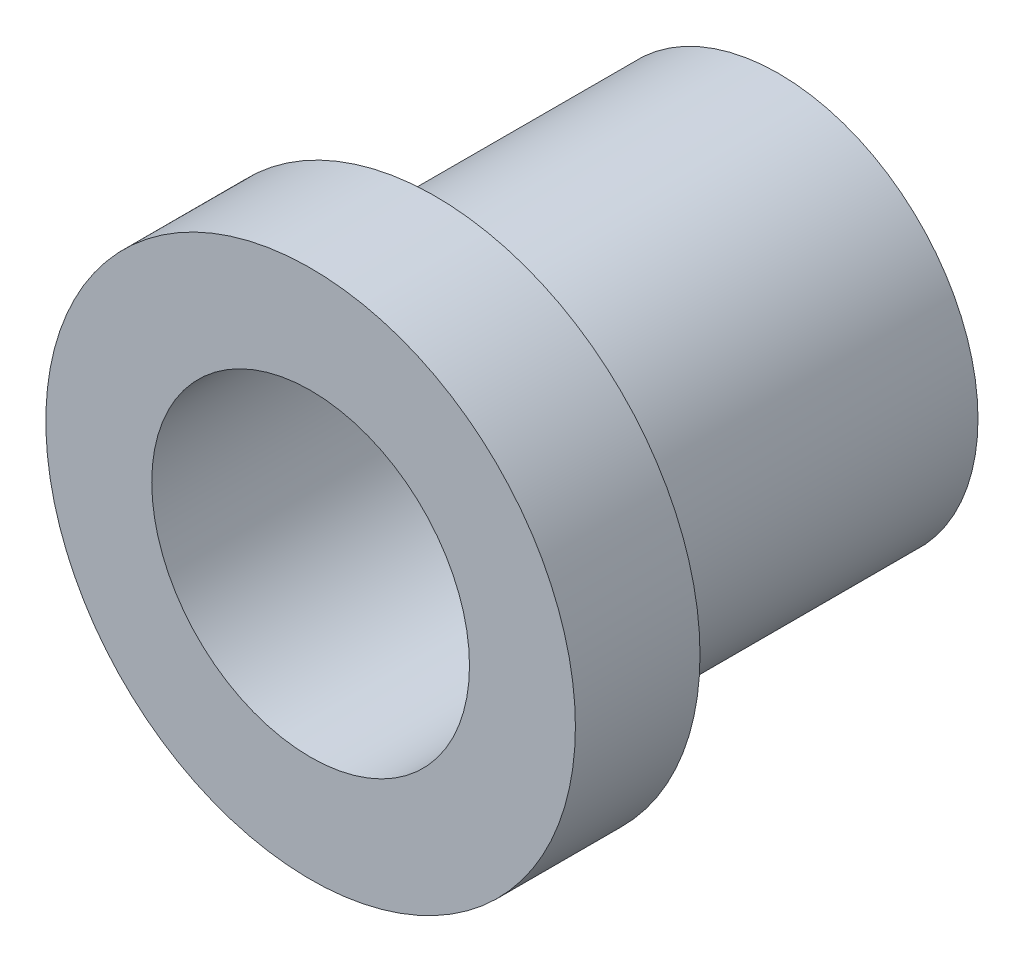
ISO-10303-21;
HEADER;
FILE_DESCRIPTION(('STEP AP214'),'2;1');
FILE_NAME('part.step','',(''),(''),'','','');
FILE_SCHEMA(('AUTOMOTIVE_DESIGN { 1 0 10303 214 1 1 1 1 }'));
ENDSEC;
DATA;
#1=APPLICATION_CONTEXT('core data for automotive mechanical design processes');
#2=APPLICATION_PROTOCOL_DEFINITION('international standard','automotive_design',2000,#1);
#3=PRODUCT_CONTEXT('',#1,'mechanical');
#4=PRODUCT('Part','Part','',(#3));
#5=PRODUCT_RELATED_PRODUCT_CATEGORY('part','',(#4));
#6=PRODUCT_DEFINITION_FORMATION('','',#4);
#7=PRODUCT_DEFINITION_CONTEXT('part definition',#1,'design');
#8=PRODUCT_DEFINITION('design','',#6,#7);
#9=PRODUCT_DEFINITION_SHAPE('','',#8);
#10=(LENGTH_UNIT() NAMED_UNIT(*) SI_UNIT(.MILLI.,.METRE.));
#11=(NAMED_UNIT(*) PLANE_ANGLE_UNIT() SI_UNIT($,.RADIAN.));
#12=(NAMED_UNIT(*) SI_UNIT($,.STERADIAN.) SOLID_ANGLE_UNIT());
#13=UNCERTAINTY_MEASURE_WITH_UNIT(LENGTH_MEASURE(1.E-05),#10,'distance_accuracy_value','');
#14=(GEOMETRIC_REPRESENTATION_CONTEXT(3) GLOBAL_UNCERTAINTY_ASSIGNED_CONTEXT((#13)) GLOBAL_UNIT_ASSIGNED_CONTEXT((#10,
#11,#12)) REPRESENTATION_CONTEXT('',''));
#15=CARTESIAN_POINT('',(0.,0.,0.));
#16=DIRECTION('',(0.,0.,1.));
#17=DIRECTION('',(1.,0.,0.));
#18=AXIS2_PLACEMENT_3D('',#15,#16,#17);
#19=CARTESIAN_POINT('',(0.,0.,0.));
#20=DIRECTION('',(0.,0.,1.));
#21=DIRECTION('',(1.,0.,0.));
#22=AXIS2_PLACEMENT_3D('',#19,#20,#21);
#23=PLANE('',#22);
#24=CARTESIAN_POINT('',(0.,0.,0.));
#25=DIRECTION('',(0.,0.,1.));
#26=DIRECTION('',(1.,0.,0.));
#27=AXIS2_PLACEMENT_3D('',#24,#25,#26);
#28=CIRCLE('',#27,5.3975);
#29=CARTESIAN_POINT('',(5.3975,0.,0.));
#30=VERTEX_POINT('',#29);
#31=EDGE_CURVE('E42',#30,#30,#28,.T.);
#32=ORIENTED_EDGE('',*,*,#31,.F.);
#33=EDGE_LOOP('',(#32));
#34=FACE_BOUND('',#33,.T.);
#35=CARTESIAN_POINT('',(0.,0.,0.));
#36=DIRECTION('',(0.,0.,1.));
#37=DIRECTION('',(1.,0.,0.));
#38=AXIS2_PLACEMENT_3D('',#35,#36,#37);
#39=CIRCLE('',#38,4.064);
#40=CARTESIAN_POINT('',(4.064,0.,0.));
#41=VERTEX_POINT('',#40);
#42=EDGE_CURVE('E10',#41,#41,#39,.F.);
#43=ORIENTED_EDGE('',*,*,#42,.F.);
#44=EDGE_LOOP('',(#43));
#45=FACE_BOUND('',#44,.T.);
#46=ADVANCED_FACE('F31',(#34,#45),#23,.F.);
#47=CARTESIAN_POINT('',(0.,0.,2.54));
#48=DIRECTION('',(0.,0.,1.));
#49=DIRECTION('',(1.,0.,0.));
#50=AXIS2_PLACEMENT_3D('',#47,#48,#49);
#51=PLANE('',#50);
#52=CARTESIAN_POINT('',(0.,0.,2.54));
#53=DIRECTION('',(0.,0.,1.));
#54=DIRECTION('',(1.,0.,0.));
#55=AXIS2_PLACEMENT_3D('',#52,#53,#54);
#56=CIRCLE('',#55,5.3975);
#57=CARTESIAN_POINT('',(5.3975,0.,2.54));
#58=VERTEX_POINT('',#57);
#59=EDGE_CURVE('E38',#58,#58,#56,.T.);
#60=ORIENTED_EDGE('',*,*,#59,.T.);
#61=EDGE_LOOP('',(#60));
#62=FACE_BOUND('',#61,.T.);
#63=CARTESIAN_POINT('',(0.,0.,2.54));
#64=DIRECTION('',(0.,0.,1.));
#65=DIRECTION('',(1.,0.,0.));
#66=AXIS2_PLACEMENT_3D('',#63,#64,#65);
#67=CIRCLE('',#66,3.2385);
#68=CARTESIAN_POINT('',(3.2385,0.,2.54));
#69=VERTEX_POINT('',#68);
#70=EDGE_CURVE('E47',#69,#69,#67,.T.);
#71=ORIENTED_EDGE('',*,*,#70,.F.);
#72=EDGE_LOOP('',(#71));
#73=FACE_BOUND('',#72,.T.);
#74=ADVANCED_FACE('F74',(#62,#73),#51,.T.);
#75=CARTESIAN_POINT('',(0.,0.,2.54));
#76=DIRECTION('',(0.,0.,-1.));
#77=DIRECTION('',(-1.,0.,0.));
#78=AXIS2_PLACEMENT_3D('',#75,#76,#77);
#79=CYLINDRICAL_SURFACE('',#78,5.3975);
#80=ORIENTED_EDGE('',*,*,#59,.F.);
#81=EDGE_LOOP('',(#80));
#82=FACE_BOUND('',#81,.T.);
#83=ORIENTED_EDGE('',*,*,#31,.T.);
#84=EDGE_LOOP('',(#83));
#85=FACE_BOUND('',#84,.T.);
#86=ADVANCED_FACE('F33',(#82,#85),#79,.T.);
#87=CARTESIAN_POINT('',(0.,0.,2.54));
#88=DIRECTION('',(0.,0.,-1.));
#89=DIRECTION('',(-1.,0.,0.));
#90=AXIS2_PLACEMENT_3D('',#87,#88,#89);
#91=CYLINDRICAL_SURFACE('',#90,3.2385);
#92=ORIENTED_EDGE('',*,*,#70,.T.);
#93=EDGE_LOOP('',(#92));
#94=FACE_BOUND('',#93,.T.);
#95=CARTESIAN_POINT('',(0.,0.,-7.));
#96=DIRECTION('',(0.,0.,-1.));
#97=DIRECTION('',(-1.,0.,0.));
#98=AXIS2_PLACEMENT_3D('',#95,#96,#97);
#99=CIRCLE('',#98,3.2385);
#100=CARTESIAN_POINT('',(-3.2385,0.,-7.));
#101=VERTEX_POINT('',#100);
#102=EDGE_CURVE('E54',#101,#101,#99,.T.);
#103=ORIENTED_EDGE('',*,*,#102,.T.);
#104=EDGE_LOOP('',(#103));
#105=FACE_BOUND('',#104,.T.);
#106=ADVANCED_FACE('F58',(#94,#105),#91,.F.);
#107=CARTESIAN_POINT('',(0.,0.,-7.));
#108=DIRECTION('',(0.,0.,-1.));
#109=DIRECTION('',(-1.,0.,0.));
#110=AXIS2_PLACEMENT_3D('',#107,#108,#109);
#111=PLANE('',#110);
#112=CARTESIAN_POINT('',(0.,0.,-7.));
#113=DIRECTION('',(0.,0.,-1.));
#114=DIRECTION('',(-1.,0.,0.));
#115=AXIS2_PLACEMENT_3D('',#112,#113,#114);
#116=CIRCLE('',#115,4.064);
#117=CARTESIAN_POINT('',(-4.064,0.,-7.));
#118=VERTEX_POINT('',#117);
#119=EDGE_CURVE('E51',#118,#118,#116,.T.);
#120=ORIENTED_EDGE('',*,*,#119,.T.);
#121=EDGE_LOOP('',(#120));
#122=FACE_BOUND('',#121,.T.);
#123=ORIENTED_EDGE('',*,*,#102,.F.);
#124=EDGE_LOOP('',(#123));
#125=FACE_BOUND('',#124,.T.);
#126=ADVANCED_FACE('F60',(#122,#125),#111,.T.);
#127=CARTESIAN_POINT('',(0.,0.,-7.));
#128=DIRECTION('',(0.,0.,1.));
#129=DIRECTION('',(1.,0.,0.));
#130=AXIS2_PLACEMENT_3D('',#127,#128,#129);
#131=CYLINDRICAL_SURFACE('',#130,4.064);
#132=ORIENTED_EDGE('',*,*,#119,.F.);
#133=EDGE_LOOP('',(#132));
#134=FACE_BOUND('',#133,.T.);
#135=ORIENTED_EDGE('',*,*,#42,.T.);
#136=EDGE_LOOP('',(#135));
#137=FACE_BOUND('',#136,.T.);
#138=ADVANCED_FACE('F62',(#134,#137),#131,.T.);
#139=CLOSED_SHELL('',(#46,#74,#86,#106,#126,#138));
#140=MANIFOLD_SOLID_BREP('B2',#139);
#141=ADVANCED_BREP_SHAPE_REPRESENTATION('',(#18,#140),#14);
#142=SHAPE_DEFINITION_REPRESENTATION(#9,#141);
ENDSEC;
END-ISO-10303-21;
